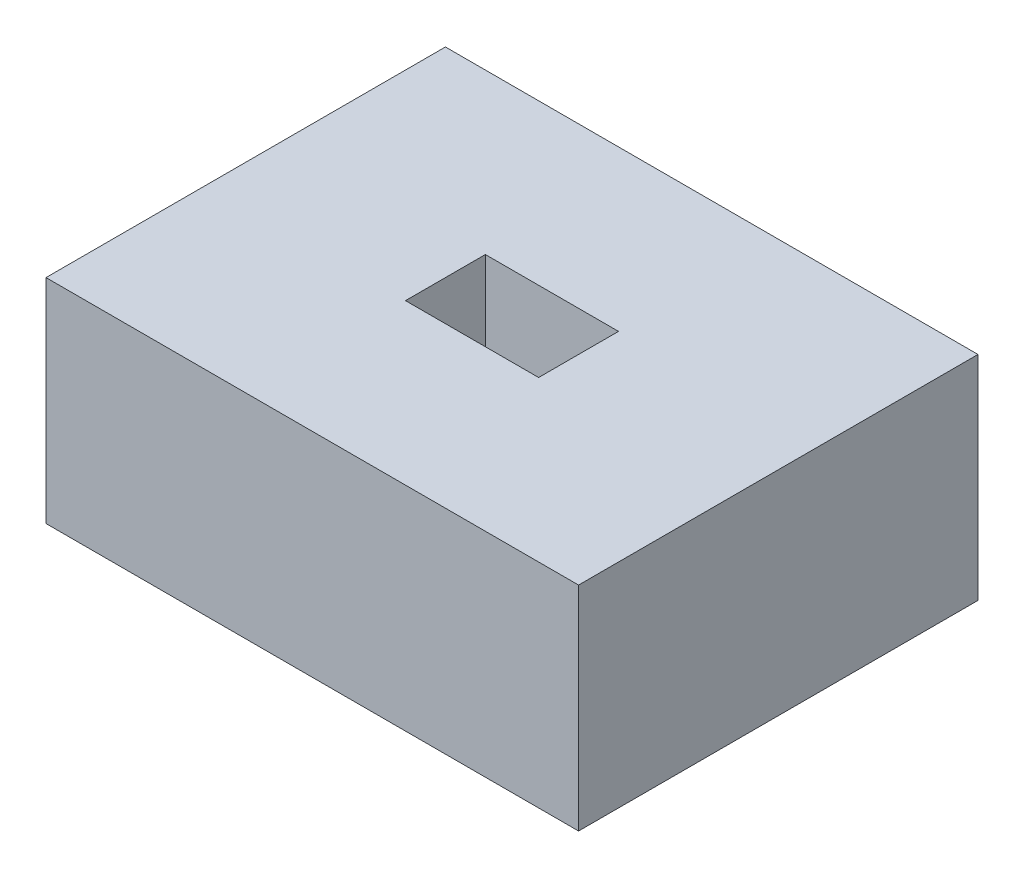
ISO-10303-21;
HEADER;
FILE_DESCRIPTION(('STEP AP214'),'2;1');
FILE_NAME('part.step','',(''),(''),'','','');
FILE_SCHEMA(('AUTOMOTIVE_DESIGN { 1 0 10303 214 1 1 1 1 }'));
ENDSEC;
DATA;
#1=APPLICATION_CONTEXT('core data for automotive mechanical design processes');
#2=APPLICATION_PROTOCOL_DEFINITION('international standard','automotive_design',2000,#1);
#3=PRODUCT_CONTEXT('',#1,'mechanical');
#4=PRODUCT('Part','Part','',(#3));
#5=PRODUCT_RELATED_PRODUCT_CATEGORY('part','',(#4));
#6=PRODUCT_DEFINITION_FORMATION('','',#4);
#7=PRODUCT_DEFINITION_CONTEXT('part definition',#1,'design');
#8=PRODUCT_DEFINITION('design','',#6,#7);
#9=PRODUCT_DEFINITION_SHAPE('','',#8);
#10=(LENGTH_UNIT() NAMED_UNIT(*) SI_UNIT(.MILLI.,.METRE.));
#11=(NAMED_UNIT(*) PLANE_ANGLE_UNIT() SI_UNIT($,.RADIAN.));
#12=(NAMED_UNIT(*) SI_UNIT($,.STERADIAN.) SOLID_ANGLE_UNIT());
#13=UNCERTAINTY_MEASURE_WITH_UNIT(LENGTH_MEASURE(1.E-05),#10,'distance_accuracy_value','');
#14=(GEOMETRIC_REPRESENTATION_CONTEXT(3) GLOBAL_UNCERTAINTY_ASSIGNED_CONTEXT((#13)) GLOBAL_UNIT_ASSIGNED_CONTEXT((#10,
#11,#12)) REPRESENTATION_CONTEXT('',''));
#15=CARTESIAN_POINT('',(0.,0.,0.));
#16=DIRECTION('',(0.,0.,1.));
#17=DIRECTION('',(1.,0.,0.));
#18=AXIS2_PLACEMENT_3D('',#15,#16,#17);
#19=CARTESIAN_POINT('',(10.,8.,7.5));
#20=DIRECTION('',(-1.,0.,0.));
#21=DIRECTION('',(0.,0.,1.));
#22=AXIS2_PLACEMENT_3D('',#19,#20,#21);
#23=PLANE('',#22);
#24=DIRECTION('',(0.,0.,-1.));
#25=VECTOR('',#24,1.);
#26=CARTESIAN_POINT('',(10.,0.,7.5));
#27=LINE('',#26,#25);
#28=CARTESIAN_POINT('',(10.,0.,7.5));
#29=VERTEX_POINT('',#28);
#30=CARTESIAN_POINT('',(10.,0.,-7.5));
#31=VERTEX_POINT('',#30);
#32=EDGE_CURVE('E171',#29,#31,#27,.T.);
#33=ORIENTED_EDGE('',*,*,#32,.T.);
#34=DIRECTION('',(0.,-1.,0.));
#35=VECTOR('',#34,1.);
#36=CARTESIAN_POINT('',(10.,8.,-7.5));
#37=LINE('',#36,#35);
#38=CARTESIAN_POINT('',(10.,8.,-7.5));
#39=VERTEX_POINT('',#38);
#40=EDGE_CURVE('E11',#39,#31,#37,.T.);
#41=ORIENTED_EDGE('',*,*,#40,.F.);
#42=DIRECTION('',(0.,0.,-1.));
#43=VECTOR('',#42,1.);
#44=CARTESIAN_POINT('',(10.,8.,7.5));
#45=LINE('',#44,#43);
#46=CARTESIAN_POINT('',(10.,8.,7.5));
#47=VERTEX_POINT('',#46);
#48=EDGE_CURVE('E178',#47,#39,#45,.T.);
#49=ORIENTED_EDGE('',*,*,#48,.F.);
#50=DIRECTION('',(0.,-1.,0.));
#51=VECTOR('',#50,1.);
#52=CARTESIAN_POINT('',(10.,8.,7.5));
#53=LINE('',#52,#51);
#54=EDGE_CURVE('E188',#47,#29,#53,.T.);
#55=ORIENTED_EDGE('',*,*,#54,.T.);
#56=EDGE_LOOP('',(#33,#41,#49,#55));
#57=FACE_BOUND('',#56,.T.);
#58=ADVANCED_FACE('F32',(#57),#23,.F.);
#59=CARTESIAN_POINT('',(-10.,8.,-7.5));
#60=DIRECTION('',(0.,0.,1.));
#61=DIRECTION('',(1.,0.,0.));
#62=AXIS2_PLACEMENT_3D('',#59,#60,#61);
#63=PLANE('',#62);
#64=DIRECTION('',(-1.,0.,0.));
#65=VECTOR('',#64,1.);
#66=CARTESIAN_POINT('',(-10.,0.,-7.5));
#67=LINE('',#66,#65);
#68=CARTESIAN_POINT('',(-10.,0.,-7.5));
#69=VERTEX_POINT('',#68);
#70=EDGE_CURVE('E191',#31,#69,#67,.T.);
#71=ORIENTED_EDGE('',*,*,#70,.T.);
#72=DIRECTION('',(0.,-1.,0.));
#73=VECTOR('',#72,1.);
#74=CARTESIAN_POINT('',(-10.,8.,-7.5));
#75=LINE('',#74,#73);
#76=CARTESIAN_POINT('',(-10.,8.,-7.5));
#77=VERTEX_POINT('',#76);
#78=EDGE_CURVE('E39',#77,#69,#75,.T.);
#79=ORIENTED_EDGE('',*,*,#78,.F.);
#80=DIRECTION('',(-1.,0.,0.));
#81=VECTOR('',#80,1.);
#82=CARTESIAN_POINT('',(-10.,8.,-7.5));
#83=LINE('',#82,#81);
#84=EDGE_CURVE('E181',#39,#77,#83,.T.);
#85=ORIENTED_EDGE('',*,*,#84,.F.);
#86=ORIENTED_EDGE('',*,*,#40,.T.);
#87=EDGE_LOOP('',(#71,#79,#85,#86));
#88=FACE_BOUND('',#87,.T.);
#89=ADVANCED_FACE('F221',(#88),#63,.F.);
#90=CARTESIAN_POINT('',(-10.,8.,7.5));
#91=DIRECTION('',(1.,0.,0.));
#92=DIRECTION('',(0.,0.,-1.));
#93=AXIS2_PLACEMENT_3D('',#90,#91,#92);
#94=PLANE('',#93);
#95=DIRECTION('',(0.,0.,1.));
#96=VECTOR('',#95,1.);
#97=CARTESIAN_POINT('',(-10.,0.,7.5));
#98=LINE('',#97,#96);
#99=CARTESIAN_POINT('',(-10.,0.,7.5));
#100=VERTEX_POINT('',#99);
#101=EDGE_CURVE('E193',#69,#100,#98,.T.);
#102=ORIENTED_EDGE('',*,*,#101,.T.);
#103=DIRECTION('',(0.,-1.,0.));
#104=VECTOR('',#103,1.);
#105=CARTESIAN_POINT('',(-10.,8.,7.5));
#106=LINE('',#105,#104);
#107=CARTESIAN_POINT('',(-10.,8.,7.5));
#108=VERTEX_POINT('',#107);
#109=EDGE_CURVE('E198',#108,#100,#106,.T.);
#110=ORIENTED_EDGE('',*,*,#109,.F.);
#111=DIRECTION('',(0.,0.,1.));
#112=VECTOR('',#111,1.);
#113=CARTESIAN_POINT('',(-10.,8.,7.5));
#114=LINE('',#113,#112);
#115=EDGE_CURVE('E184',#77,#108,#114,.T.);
#116=ORIENTED_EDGE('',*,*,#115,.F.);
#117=ORIENTED_EDGE('',*,*,#78,.T.);
#118=EDGE_LOOP('',(#102,#110,#116,#117));
#119=FACE_BOUND('',#118,.T.);
#120=ADVANCED_FACE('F205',(#119),#94,.F.);
#121=CARTESIAN_POINT('',(-10.,8.,7.5));
#122=DIRECTION('',(0.,0.,-1.));
#123=DIRECTION('',(-1.,0.,0.));
#124=AXIS2_PLACEMENT_3D('',#121,#122,#123);
#125=PLANE('',#124);
#126=DIRECTION('',(1.,0.,0.));
#127=VECTOR('',#126,1.);
#128=CARTESIAN_POINT('',(-10.,0.,7.5));
#129=LINE('',#128,#127);
#130=EDGE_CURVE('E182',#100,#29,#129,.T.);
#131=ORIENTED_EDGE('',*,*,#130,.T.);
#132=ORIENTED_EDGE('',*,*,#54,.F.);
#133=DIRECTION('',(1.,0.,0.));
#134=VECTOR('',#133,1.);
#135=CARTESIAN_POINT('',(-10.,8.,7.5));
#136=LINE('',#135,#134);
#137=EDGE_CURVE('E186',#108,#47,#136,.T.);
#138=ORIENTED_EDGE('',*,*,#137,.F.);
#139=ORIENTED_EDGE('',*,*,#109,.T.);
#140=EDGE_LOOP('',(#131,#132,#138,#139));
#141=FACE_BOUND('',#140,.T.);
#142=ADVANCED_FACE('F214',(#141),#125,.F.);
#143=CARTESIAN_POINT('',(0.,8.,0.));
#144=DIRECTION('',(0.,-1.,0.));
#145=DIRECTION('',(0.,0.,-1.));
#146=AXIS2_PLACEMENT_3D('',#143,#144,#145);
#147=PLANE('',#146);
#148=DIRECTION('',(-1.,0.,0.));
#149=VECTOR('',#148,1.);
#150=CARTESIAN_POINT('',(-2.5,8.,-1.5));
#151=LINE('',#150,#149);
#152=CARTESIAN_POINT('',(2.5,8.,-1.5));
#153=VERTEX_POINT('',#152);
#154=CARTESIAN_POINT('',(-2.5,8.,-1.5));
#155=VERTEX_POINT('',#154);
#156=EDGE_CURVE('E142',#153,#155,#151,.T.);
#157=ORIENTED_EDGE('',*,*,#156,.F.);
#158=DIRECTION('',(0.,0.,-1.));
#159=VECTOR('',#158,1.);
#160=CARTESIAN_POINT('',(2.5,8.,1.5));
#161=LINE('',#160,#159);
#162=CARTESIAN_POINT('',(2.5,8.,1.5));
#163=VERTEX_POINT('',#162);
#164=EDGE_CURVE('E140',#163,#153,#161,.T.);
#165=ORIENTED_EDGE('',*,*,#164,.F.);
#166=DIRECTION('',(1.,0.,0.));
#167=VECTOR('',#166,1.);
#168=CARTESIAN_POINT('',(-2.5,8.,1.5));
#169=LINE('',#168,#167);
#170=CARTESIAN_POINT('',(-2.5,8.,1.5));
#171=VERTEX_POINT('',#170);
#172=EDGE_CURVE('E152',#171,#163,#169,.T.);
#173=ORIENTED_EDGE('',*,*,#172,.F.);
#174=DIRECTION('',(0.,0.,1.));
#175=VECTOR('',#174,1.);
#176=CARTESIAN_POINT('',(-2.5,8.,1.5));
#177=LINE('',#176,#175);
#178=EDGE_CURVE('E164',#155,#171,#177,.T.);
#179=ORIENTED_EDGE('',*,*,#178,.F.);
#180=EDGE_LOOP('',(#157,#165,#173,#179));
#181=FACE_BOUND('',#180,.T.);
#182=ORIENTED_EDGE('',*,*,#48,.T.);
#183=ORIENTED_EDGE('',*,*,#84,.T.);
#184=ORIENTED_EDGE('',*,*,#115,.T.);
#185=ORIENTED_EDGE('',*,*,#137,.T.);
#186=EDGE_LOOP('',(#182,#183,#184,#185));
#187=FACE_BOUND('',#186,.T.);
#188=ADVANCED_FACE('F220',(#181,#187),#147,.F.);
#189=CARTESIAN_POINT('',(0.,0.,0.));
#190=DIRECTION('',(0.,-1.,0.));
#191=DIRECTION('',(0.,0.,-1.));
#192=AXIS2_PLACEMENT_3D('',#189,#190,#191);
#193=PLANE('',#192);
#194=DIRECTION('',(-1.,0.,0.));
#195=VECTOR('',#194,1.);
#196=CARTESIAN_POINT('',(2.5,0.,1.5));
#197=LINE('',#196,#195);
#198=CARTESIAN_POINT('',(2.5,0.,1.5));
#199=VERTEX_POINT('',#198);
#200=CARTESIAN_POINT('',(-2.5,0.,1.5));
#201=VERTEX_POINT('',#200);
#202=EDGE_CURVE('E46',#199,#201,#197,.T.);
#203=ORIENTED_EDGE('',*,*,#202,.F.);
#204=DIRECTION('',(0.,0.,1.));
#205=VECTOR('',#204,1.);
#206=CARTESIAN_POINT('',(2.5,0.,-1.5));
#207=LINE('',#206,#205);
#208=CARTESIAN_POINT('',(2.5,0.,-1.5));
#209=VERTEX_POINT('',#208);
#210=EDGE_CURVE('E50',#209,#199,#207,.T.);
#211=ORIENTED_EDGE('',*,*,#210,.F.);
#212=DIRECTION('',(1.,0.,0.));
#213=VECTOR('',#212,1.);
#214=CARTESIAN_POINT('',(-2.5,0.,-1.5));
#215=LINE('',#214,#213);
#216=CARTESIAN_POINT('',(-2.5,0.,-1.5));
#217=VERTEX_POINT('',#216);
#218=EDGE_CURVE('E366',#217,#209,#215,.T.);
#219=ORIENTED_EDGE('',*,*,#218,.F.);
#220=DIRECTION('',(0.,0.,-1.));
#221=VECTOR('',#220,1.);
#222=CARTESIAN_POINT('',(-2.5,0.,1.5));
#223=LINE('',#222,#221);
#224=EDGE_CURVE('E372',#201,#217,#223,.T.);
#225=ORIENTED_EDGE('',*,*,#224,.F.);
#226=EDGE_LOOP('',(#203,#211,#219,#225));
#227=FACE_BOUND('',#226,.T.);
#228=ORIENTED_EDGE('',*,*,#32,.F.);
#229=ORIENTED_EDGE('',*,*,#130,.F.);
#230=ORIENTED_EDGE('',*,*,#101,.F.);
#231=ORIENTED_EDGE('',*,*,#70,.F.);
#232=EDGE_LOOP('',(#228,#229,#230,#231));
#233=FACE_BOUND('',#232,.T.);
#234=ADVANCED_FACE('F211',(#227,#233),#193,.T.);
#235=CARTESIAN_POINT('',(2.5,4.8,1.5));
#236=DIRECTION('',(1.,0.,0.));
#237=DIRECTION('',(0.,0.,-1.));
#238=AXIS2_PLACEMENT_3D('',#235,#236,#237);
#239=PLANE('',#238);
#240=ORIENTED_EDGE('',*,*,#164,.T.);
#241=DIRECTION('',(0.,1.,0.));
#242=VECTOR('',#241,1.);
#243=CARTESIAN_POINT('',(2.5,4.8,-1.5));
#244=LINE('',#243,#242);
#245=CARTESIAN_POINT('',(2.5,4.8,-1.5));
#246=VERTEX_POINT('',#245);
#247=EDGE_CURVE('E160',#246,#153,#244,.T.);
#248=ORIENTED_EDGE('',*,*,#247,.F.);
#249=DIRECTION('',(0.,0.,-1.));
#250=VECTOR('',#249,1.);
#251=CARTESIAN_POINT('',(2.5,4.8,1.5));
#252=LINE('',#251,#250);
#253=CARTESIAN_POINT('',(2.5,4.8,1.5));
#254=VERTEX_POINT('',#253);
#255=EDGE_CURVE('E148',#254,#246,#252,.T.);
#256=ORIENTED_EDGE('',*,*,#255,.F.);
#257=DIRECTION('',(0.,1.,0.));
#258=VECTOR('',#257,1.);
#259=CARTESIAN_POINT('',(2.5,4.8,1.5));
#260=LINE('',#259,#258);
#261=EDGE_CURVE('E169',#254,#163,#260,.T.);
#262=ORIENTED_EDGE('',*,*,#261,.T.);
#263=EDGE_LOOP('',(#240,#248,#256,#262));
#264=FACE_BOUND('',#263,.T.);
#265=ADVANCED_FACE('F233',(#264),#239,.F.);
#266=CARTESIAN_POINT('',(-2.5,4.8,1.5));
#267=DIRECTION('',(0.,0.,1.));
#268=DIRECTION('',(1.,0.,0.));
#269=AXIS2_PLACEMENT_3D('',#266,#267,#268);
#270=PLANE('',#269);
#271=ORIENTED_EDGE('',*,*,#172,.T.);
#272=ORIENTED_EDGE('',*,*,#261,.F.);
#273=DIRECTION('',(1.,0.,0.));
#274=VECTOR('',#273,1.);
#275=CARTESIAN_POINT('',(-2.5,4.8,1.5));
#276=LINE('',#275,#274);
#277=CARTESIAN_POINT('',(-2.5,4.8,1.5));
#278=VERTEX_POINT('',#277);
#279=EDGE_CURVE('E158',#278,#254,#276,.T.);
#280=ORIENTED_EDGE('',*,*,#279,.F.);
#281=DIRECTION('',(0.,1.,0.));
#282=VECTOR('',#281,1.);
#283=CARTESIAN_POINT('',(-2.5,4.8,1.5));
#284=LINE('',#283,#282);
#285=EDGE_CURVE('E172',#278,#171,#284,.T.);
#286=ORIENTED_EDGE('',*,*,#285,.T.);
#287=EDGE_LOOP('',(#271,#272,#280,#286));
#288=FACE_BOUND('',#287,.T.);
#289=ADVANCED_FACE('F239',(#288),#270,.F.);
#290=CARTESIAN_POINT('',(-2.5,4.8,1.5));
#291=DIRECTION('',(-1.,0.,0.));
#292=DIRECTION('',(0.,0.,1.));
#293=AXIS2_PLACEMENT_3D('',#290,#291,#292);
#294=PLANE('',#293);
#295=ORIENTED_EDGE('',*,*,#178,.T.);
#296=ORIENTED_EDGE('',*,*,#285,.F.);
#297=DIRECTION('',(0.,0.,1.));
#298=VECTOR('',#297,1.);
#299=CARTESIAN_POINT('',(-2.5,4.8,1.5));
#300=LINE('',#299,#298);
#301=CARTESIAN_POINT('',(-2.5,4.8,-1.5));
#302=VERTEX_POINT('',#301);
#303=EDGE_CURVE('E155',#302,#278,#300,.T.);
#304=ORIENTED_EDGE('',*,*,#303,.F.);
#305=DIRECTION('',(0.,1.,0.));
#306=VECTOR('',#305,1.);
#307=CARTESIAN_POINT('',(-2.5,4.8,-1.5));
#308=LINE('',#307,#306);
#309=EDGE_CURVE('E174',#302,#155,#308,.T.);
#310=ORIENTED_EDGE('',*,*,#309,.T.);
#311=EDGE_LOOP('',(#295,#296,#304,#310));
#312=FACE_BOUND('',#311,.T.);
#313=ADVANCED_FACE('F245',(#312),#294,.F.);
#314=CARTESIAN_POINT('',(-2.5,4.8,-1.5));
#315=DIRECTION('',(0.,0.,-1.));
#316=DIRECTION('',(-1.,0.,0.));
#317=AXIS2_PLACEMENT_3D('',#314,#315,#316);
#318=PLANE('',#317);
#319=ORIENTED_EDGE('',*,*,#156,.T.);
#320=ORIENTED_EDGE('',*,*,#309,.F.);
#321=DIRECTION('',(-1.,0.,0.));
#322=VECTOR('',#321,1.);
#323=CARTESIAN_POINT('',(-2.5,4.8,-1.5));
#324=LINE('',#323,#322);
#325=EDGE_CURVE('E151',#246,#302,#324,.T.);
#326=ORIENTED_EDGE('',*,*,#325,.F.);
#327=ORIENTED_EDGE('',*,*,#247,.T.);
#328=EDGE_LOOP('',(#319,#320,#326,#327));
#329=FACE_BOUND('',#328,.T.);
#330=ADVANCED_FACE('F241',(#329),#318,.F.);
#331=CARTESIAN_POINT('',(0.,4.8,0.));
#332=DIRECTION('',(0.,-1.,0.));
#333=DIRECTION('',(0.,0.,-1.));
#334=AXIS2_PLACEMENT_3D('',#331,#332,#333);
#335=PLANE('',#334);
#336=ORIENTED_EDGE('',*,*,#255,.T.);
#337=ORIENTED_EDGE('',*,*,#325,.T.);
#338=ORIENTED_EDGE('',*,*,#303,.T.);
#339=ORIENTED_EDGE('',*,*,#279,.T.);
#340=EDGE_LOOP('',(#336,#337,#338,#339));
#341=FACE_BOUND('',#340,.T.);
#342=ADVANCED_FACE('F244',(#341),#335,.F.);
#343=CARTESIAN_POINT('',(2.5,-3.,1.5));
#344=DIRECTION('',(0.,0.,-1.));
#345=DIRECTION('',(-1.,0.,0.));
#346=AXIS2_PLACEMENT_3D('',#343,#344,#345);
#347=PLANE('',#346);
#348=ORIENTED_EDGE('',*,*,#202,.T.);
#349=DIRECTION('',(0.,1.,0.));
#350=VECTOR('',#349,1.);
#351=CARTESIAN_POINT('',(-2.5,-3.,1.5));
#352=LINE('',#351,#350);
#353=CARTESIAN_POINT('',(-2.5,-3.,1.5));
#354=VERTEX_POINT('',#353);
#355=EDGE_CURVE('E123',#354,#201,#352,.T.);
#356=ORIENTED_EDGE('',*,*,#355,.F.);
#357=DIRECTION('',(-1.,0.,0.));
#358=VECTOR('',#357,1.);
#359=CARTESIAN_POINT('',(2.5,-3.,1.5));
#360=LINE('',#359,#358);
#361=CARTESIAN_POINT('',(2.5,-3.,1.5));
#362=VERTEX_POINT('',#361);
#363=EDGE_CURVE('E129',#362,#354,#360,.T.);
#364=ORIENTED_EDGE('',*,*,#363,.F.);
#365=DIRECTION('',(0.,1.,0.));
#366=VECTOR('',#365,1.);
#367=CARTESIAN_POINT('',(2.5,-3.,1.5));
#368=LINE('',#367,#366);
#369=EDGE_CURVE('E364',#362,#199,#368,.T.);
#370=ORIENTED_EDGE('',*,*,#369,.T.);
#371=EDGE_LOOP('',(#348,#356,#364,#370));
#372=FACE_BOUND('',#371,.T.);
#373=ADVANCED_FACE('F139',(#372),#347,.F.);
#374=CARTESIAN_POINT('',(-2.5,-3.,1.5));
#375=DIRECTION('',(1.,0.,0.));
#376=DIRECTION('',(0.,0.,-1.));
#377=AXIS2_PLACEMENT_3D('',#374,#375,#376);
#378=PLANE('',#377);
#379=ORIENTED_EDGE('',*,*,#224,.T.);
#380=DIRECTION('',(0.,1.,0.));
#381=VECTOR('',#380,1.);
#382=CARTESIAN_POINT('',(-2.5,-3.,-1.5));
#383=LINE('',#382,#381);
#384=CARTESIAN_POINT('',(-2.5,-3.,-1.5));
#385=VERTEX_POINT('',#384);
#386=EDGE_CURVE('E125',#385,#217,#383,.T.);
#387=ORIENTED_EDGE('',*,*,#386,.F.);
#388=DIRECTION('',(0.,0.,-1.));
#389=VECTOR('',#388,1.);
#390=CARTESIAN_POINT('',(-2.5,-3.,1.5));
#391=LINE('',#390,#389);
#392=EDGE_CURVE('E118',#354,#385,#391,.T.);
#393=ORIENTED_EDGE('',*,*,#392,.F.);
#394=ORIENTED_EDGE('',*,*,#355,.T.);
#395=EDGE_LOOP('',(#379,#387,#393,#394));
#396=FACE_BOUND('',#395,.T.);
#397=ADVANCED_FACE('F121',(#396),#378,.F.);
#398=CARTESIAN_POINT('',(-2.5,-3.,-1.5));
#399=DIRECTION('',(0.,0.,1.));
#400=DIRECTION('',(1.,0.,0.));
#401=AXIS2_PLACEMENT_3D('',#398,#399,#400);
#402=PLANE('',#401);
#403=ORIENTED_EDGE('',*,*,#218,.T.);
#404=DIRECTION('',(0.,1.,0.));
#405=VECTOR('',#404,1.);
#406=CARTESIAN_POINT('',(2.5,-3.,-1.5));
#407=LINE('',#406,#405);
#408=CARTESIAN_POINT('',(2.5,-3.,-1.5));
#409=VERTEX_POINT('',#408);
#410=EDGE_CURVE('E144',#409,#209,#407,.T.);
#411=ORIENTED_EDGE('',*,*,#410,.F.);
#412=DIRECTION('',(1.,0.,0.));
#413=VECTOR('',#412,1.);
#414=CARTESIAN_POINT('',(-2.5,-3.,-1.5));
#415=LINE('',#414,#413);
#416=EDGE_CURVE('E128',#385,#409,#415,.T.);
#417=ORIENTED_EDGE('',*,*,#416,.F.);
#418=ORIENTED_EDGE('',*,*,#386,.T.);
#419=EDGE_LOOP('',(#403,#411,#417,#418));
#420=FACE_BOUND('',#419,.T.);
#421=ADVANCED_FACE('F260',(#420),#402,.F.);
#422=CARTESIAN_POINT('',(2.5,-3.,-1.5));
#423=DIRECTION('',(-1.,0.,0.));
#424=DIRECTION('',(0.,0.,1.));
#425=AXIS2_PLACEMENT_3D('',#422,#423,#424);
#426=PLANE('',#425);
#427=ORIENTED_EDGE('',*,*,#210,.T.);
#428=ORIENTED_EDGE('',*,*,#369,.F.);
#429=DIRECTION('',(0.,0.,1.));
#430=VECTOR('',#429,1.);
#431=CARTESIAN_POINT('',(2.5,-3.,-1.5));
#432=LINE('',#431,#430);
#433=EDGE_CURVE('E134',#409,#362,#432,.T.);
#434=ORIENTED_EDGE('',*,*,#433,.F.);
#435=ORIENTED_EDGE('',*,*,#410,.T.);
#436=EDGE_LOOP('',(#427,#428,#434,#435));
#437=FACE_BOUND('',#436,.T.);
#438=ADVANCED_FACE('F263',(#437),#426,.F.);
#439=CARTESIAN_POINT('',(0.,-3.,0.));
#440=DIRECTION('',(0.,-1.,0.));
#441=DIRECTION('',(0.,0.,-1.));
#442=AXIS2_PLACEMENT_3D('',#439,#440,#441);
#443=PLANE('',#442);
#444=ORIENTED_EDGE('',*,*,#363,.T.);
#445=ORIENTED_EDGE('',*,*,#392,.T.);
#446=ORIENTED_EDGE('',*,*,#416,.T.);
#447=ORIENTED_EDGE('',*,*,#433,.T.);
#448=EDGE_LOOP('',(#444,#445,#446,#447));
#449=FACE_BOUND('',#448,.T.);
#450=ADVANCED_FACE('F132',(#449),#443,.T.);
#451=CLOSED_SHELL('',(#58,#89,#120,#142,#188,#234,#265,#289,#313,#330,#342,#373,#397,#421,#438,#450));
#452=MANIFOLD_SOLID_BREP('B2',#451);
#453=ADVANCED_BREP_SHAPE_REPRESENTATION('',(#18,#452),#14);
#454=SHAPE_DEFINITION_REPRESENTATION(#9,#453);
ENDSEC;
END-ISO-10303-21;
